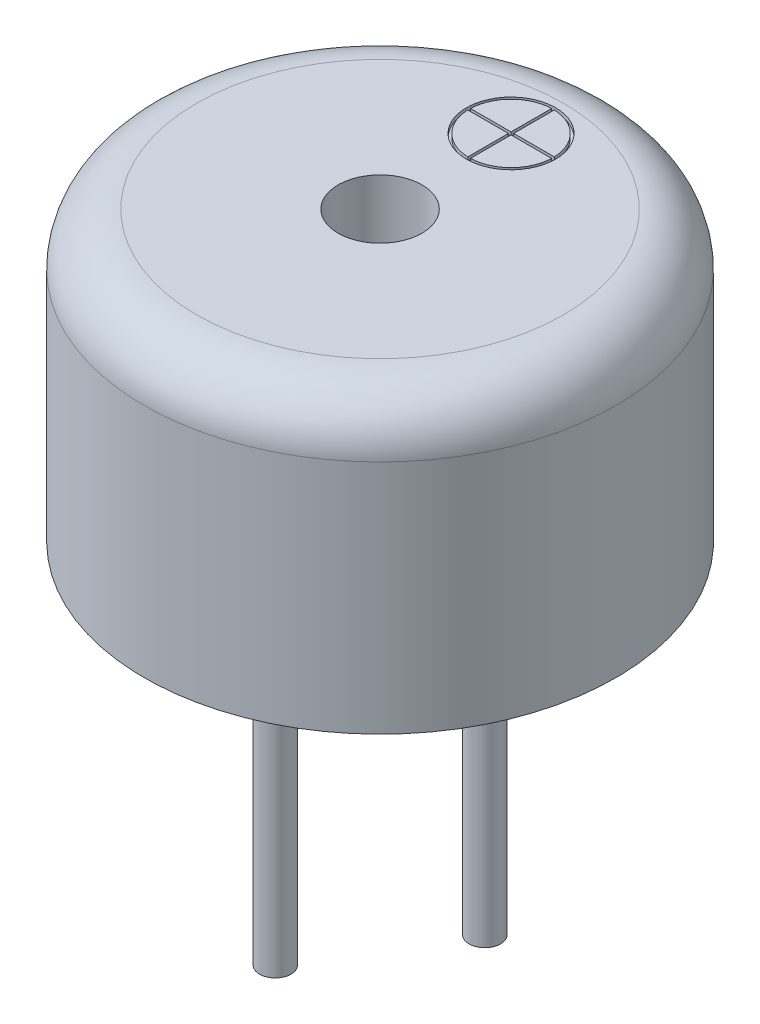
ISO-10303-21;
HEADER;
FILE_DESCRIPTION(('STEP AP214'),'2;1');
FILE_NAME('part.step','',(''),(''),'','','');
FILE_SCHEMA(('AUTOMOTIVE_DESIGN { 1 0 10303 214 1 1 1 1 }'));
ENDSEC;
DATA;
#1=APPLICATION_CONTEXT('core data for automotive mechanical design processes');
#2=APPLICATION_PROTOCOL_DEFINITION('international standard','automotive_design',2000,#1);
#3=PRODUCT_CONTEXT('',#1,'mechanical');
#4=PRODUCT('Part','Part','',(#3));
#5=PRODUCT_RELATED_PRODUCT_CATEGORY('part','',(#4));
#6=PRODUCT_DEFINITION_FORMATION('','',#4);
#7=PRODUCT_DEFINITION_CONTEXT('part definition',#1,'design');
#8=PRODUCT_DEFINITION('design','',#6,#7);
#9=PRODUCT_DEFINITION_SHAPE('','',#8);
#10=(LENGTH_UNIT() NAMED_UNIT(*) SI_UNIT(.MILLI.,.METRE.));
#11=(NAMED_UNIT(*) PLANE_ANGLE_UNIT() SI_UNIT($,.RADIAN.));
#12=(NAMED_UNIT(*) SI_UNIT($,.STERADIAN.) SOLID_ANGLE_UNIT());
#13=UNCERTAINTY_MEASURE_WITH_UNIT(LENGTH_MEASURE(1.E-05),#10,'distance_accuracy_value','');
#14=(GEOMETRIC_REPRESENTATION_CONTEXT(3) GLOBAL_UNCERTAINTY_ASSIGNED_CONTEXT((#13)) GLOBAL_UNIT_ASSIGNED_CONTEXT((#10,
#11,#12)) REPRESENTATION_CONTEXT('',''));
#15=CARTESIAN_POINT('',(0.,0.,0.));
#16=DIRECTION('',(0.,0.,1.));
#17=DIRECTION('',(1.,0.,0.));
#18=AXIS2_PLACEMENT_3D('',#15,#16,#17);
#19=CARTESIAN_POINT('',(0.,-7.5,-2.));
#20=DIRECTION('',(0.,1.,0.));
#21=DIRECTION('',(0.,0.,1.));
#22=AXIS2_PLACEMENT_3D('',#19,#20,#21);
#23=CYLINDRICAL_SURFACE('',#22,0.3);
#24=CARTESIAN_POINT('',(0.,-7.5,-2.));
#25=DIRECTION('',(0.,-1.,0.));
#26=DIRECTION('',(0.,0.,-1.));
#27=AXIS2_PLACEMENT_3D('',#24,#25,#26);
#28=CIRCLE('',#27,0.3);
#29=CARTESIAN_POINT('',(0.,-7.5,-2.3));
#30=VERTEX_POINT('',#29);
#31=EDGE_CURVE('E13',#30,#30,#28,.T.);
#32=ORIENTED_EDGE('',*,*,#31,.F.);
#33=EDGE_LOOP('',(#32));
#34=FACE_BOUND('',#33,.T.);
#35=CARTESIAN_POINT('',(0.,0.,-2.));
#36=DIRECTION('',(0.,-1.,0.));
#37=DIRECTION('',(0.,0.,-1.));
#38=AXIS2_PLACEMENT_3D('',#35,#36,#37);
#39=CIRCLE('',#38,0.3);
#40=CARTESIAN_POINT('',(0.,0.,-2.3));
#41=VERTEX_POINT('',#40);
#42=EDGE_CURVE('E80',#41,#41,#39,.T.);
#43=ORIENTED_EDGE('',*,*,#42,.T.);
#44=EDGE_LOOP('',(#43));
#45=FACE_BOUND('',#44,.T.);
#46=ADVANCED_FACE('F77',(#34,#45),#23,.T.);
#47=CARTESIAN_POINT('',(0.,-7.5,-2.));
#48=DIRECTION('',(0.,-1.,0.));
#49=DIRECTION('',(0.,0.,-1.));
#50=AXIS2_PLACEMENT_3D('',#47,#48,#49);
#51=PLANE('',#50);
#52=ORIENTED_EDGE('',*,*,#31,.T.);
#53=EDGE_LOOP('',(#52));
#54=FACE_BOUND('',#53,.T.);
#55=ADVANCED_FACE('F92',(#54),#51,.T.);
#56=CARTESIAN_POINT('',(0.,0.,-2.));
#57=DIRECTION('',(0.,-1.,0.));
#58=DIRECTION('',(0.,0.,-1.));
#59=AXIS2_PLACEMENT_3D('',#56,#57,#58);
#60=PLANE('',#59);
#61=ORIENTED_EDGE('',*,*,#42,.F.);
#62=EDGE_LOOP('',(#61));
#63=FACE_BOUND('',#62,.T.);
#64=ADVANCED_FACE('F90',(#63),#60,.F.);
#65=CLOSED_SHELL('',(#46,#55,#64));
#66=MANIFOLD_SOLID_BREP('B2',#65);
#67=CARTESIAN_POINT('',(0.,-7.5,2.));
#68=DIRECTION('',(0.,1.,0.));
#69=DIRECTION('',(0.,0.,1.));
#70=AXIS2_PLACEMENT_3D('',#67,#68,#69);
#71=CYLINDRICAL_SURFACE('',#70,0.3);
#72=CARTESIAN_POINT('',(0.,0.,2.));
#73=DIRECTION('',(0.,-1.,0.));
#74=DIRECTION('',(0.,0.,-1.));
#75=AXIS2_PLACEMENT_3D('',#72,#73,#74);
#76=CIRCLE('',#75,0.3);
#77=CARTESIAN_POINT('',(0.,0.,1.7));
#78=VERTEX_POINT('',#77);
#79=EDGE_CURVE('E76',#78,#78,#76,.T.);
#80=ORIENTED_EDGE('',*,*,#79,.T.);
#81=EDGE_LOOP('',(#80));
#82=FACE_BOUND('',#81,.T.);
#83=CARTESIAN_POINT('',(0.,-6.,2.));
#84=DIRECTION('',(0.,-1.,0.));
#85=DIRECTION('',(0.,0.,-1.));
#86=AXIS2_PLACEMENT_3D('',#83,#84,#85);
#87=CIRCLE('',#86,0.3);
#88=CARTESIAN_POINT('',(0.,-6.,1.7));
#89=VERTEX_POINT('',#88);
#90=EDGE_CURVE('E134',#89,#89,#87,.F.);
#91=ORIENTED_EDGE('',*,*,#90,.T.);
#92=EDGE_LOOP('',(#91));
#93=FACE_BOUND('',#92,.T.);
#94=ADVANCED_FACE('F128',(#82,#93),#71,.T.);
#95=CARTESIAN_POINT('',(0.,0.,2.));
#96=DIRECTION('',(0.,-1.,0.));
#97=DIRECTION('',(0.,0.,-1.));
#98=AXIS2_PLACEMENT_3D('',#95,#96,#97);
#99=PLANE('',#98);
#100=ORIENTED_EDGE('',*,*,#79,.F.);
#101=EDGE_LOOP('',(#100));
#102=FACE_BOUND('',#101,.T.);
#103=ADVANCED_FACE('F143',(#102),#99,.F.);
#104=CARTESIAN_POINT('',(0.,-6.,-2.));
#105=DIRECTION('',(0.,-1.,0.));
#106=DIRECTION('',(0.,0.,-1.));
#107=AXIS2_PLACEMENT_3D('',#104,#105,#106);
#108=PLANE('',#107);
#109=ORIENTED_EDGE('',*,*,#90,.F.);
#110=EDGE_LOOP('',(#109));
#111=FACE_BOUND('',#110,.T.);
#112=ADVANCED_FACE('F141',(#111),#108,.T.);
#113=CLOSED_SHELL('',(#94,#103,#112));
#114=MANIFOLD_SOLID_BREP('B8',#113);
#115=CARTESIAN_POINT('',(-3.5,5.5,0.));
#116=DIRECTION('',(0.,-1.,0.));
#117=DIRECTION('',(0.,0.,-1.));
#118=AXIS2_PLACEMENT_3D('',#115,#116,#117);
#119=PLANE('',#118);
#120=CARTESIAN_POINT('',(0.,5.5,-2.5));
#121=DIRECTION('',(0.,1.,0.));
#122=DIRECTION('',(1.,0.,0.));
#123=AXIS2_PLACEMENT_3D('',#120,#121,#122);
#124=CIRCLE('',#123,0.8509);
#125=CARTESIAN_POINT('',(0.8509,5.5,-2.5));
#126=VERTEX_POINT('',#125);
#127=EDGE_CURVE('E291',#126,#126,#124,.T.);
#128=ORIENTED_EDGE('',*,*,#127,.F.);
#129=EDGE_LOOP('',(#128));
#130=FACE_BOUND('',#129,.T.);
#131=CARTESIAN_POINT('',(0.,5.5,0.));
#132=DIRECTION('',(0.,-1.,0.));
#133=DIRECTION('',(0.,0.,-1.));
#134=AXIS2_PLACEMENT_3D('',#131,#132,#133);
#135=CIRCLE('',#134,3.5);
#136=CARTESIAN_POINT('',(0.,5.5,-3.5));
#137=VERTEX_POINT('',#136);
#138=EDGE_CURVE('E338',#137,#137,#135,.T.);
#139=ORIENTED_EDGE('',*,*,#138,.F.);
#140=EDGE_LOOP('',(#139));
#141=FACE_BOUND('',#140,.T.);
#142=CARTESIAN_POINT('',(0.,5.5,0.));
#143=DIRECTION('',(0.,1.,0.));
#144=DIRECTION('',(0.,0.,1.));
#145=AXIS2_PLACEMENT_3D('',#142,#143,#144);
#146=CIRCLE('',#145,0.8);
#147=CARTESIAN_POINT('',(0.,5.5,0.8));
#148=VERTEX_POINT('',#147);
#149=EDGE_CURVE('E339',#148,#148,#146,.T.);
#150=ORIENTED_EDGE('',*,*,#149,.F.);
#151=EDGE_LOOP('',(#150));
#152=FACE_BOUND('',#151,.T.);
#153=ADVANCED_FACE('F170',(#130,#141,#152),#119,.F.);
#154=CARTESIAN_POINT('',(0.,0.,0.));
#155=DIRECTION('',(0.,1.,0.));
#156=DIRECTION('',(0.,0.,1.));
#157=AXIS2_PLACEMENT_3D('',#154,#155,#156);
#158=PLANE('',#157);
#159=CARTESIAN_POINT('',(0.,0.,0.));
#160=DIRECTION('',(0.,-1.,0.));
#161=DIRECTION('',(0.,0.,-1.));
#162=AXIS2_PLACEMENT_3D('',#159,#160,#161);
#163=CIRCLE('',#162,4.5);
#164=CARTESIAN_POINT('',(0.,0.,-4.5));
#165=VERTEX_POINT('',#164);
#166=EDGE_CURVE('E126',#165,#165,#163,.T.);
#167=ORIENTED_EDGE('',*,*,#166,.T.);
#168=EDGE_LOOP('',(#167));
#169=FACE_BOUND('',#168,.T.);
#170=ADVANCED_FACE('F172',(#169),#158,.F.);
#171=CARTESIAN_POINT('',(0.,0.,0.));
#172=DIRECTION('',(0.,-1.,0.));
#173=DIRECTION('',(0.,0.,-1.));
#174=AXIS2_PLACEMENT_3D('',#171,#172,#173);
#175=CYLINDRICAL_SURFACE('',#174,4.5);
#176=ORIENTED_EDGE('',*,*,#166,.F.);
#177=EDGE_LOOP('',(#176));
#178=FACE_BOUND('',#177,.T.);
#179=CARTESIAN_POINT('',(0.,4.5,0.));
#180=DIRECTION('',(0.,-1.,0.));
#181=DIRECTION('',(0.,0.,-1.));
#182=AXIS2_PLACEMENT_3D('',#179,#180,#181);
#183=CIRCLE('',#182,4.5);
#184=CARTESIAN_POINT('',(0.,4.5,-4.5));
#185=VERTEX_POINT('',#184);
#186=EDGE_CURVE('E178',#185,#185,#183,.T.);
#187=ORIENTED_EDGE('',*,*,#186,.T.);
#188=EDGE_LOOP('',(#187));
#189=FACE_BOUND('',#188,.T.);
#190=ADVANCED_FACE('F346',(#178,#189),#175,.T.);
#191=CARTESIAN_POINT('',(0.,4.5,0.));
#192=DIRECTION('',(0.,-1.,0.));
#193=DIRECTION('',(0.,0.,-1.));
#194=AXIS2_PLACEMENT_3D('',#191,#192,#193);
#195=TOROIDAL_SURFACE('',#194,3.5,1.);
#196=ORIENTED_EDGE('',*,*,#186,.F.);
#197=EDGE_LOOP('',(#196));
#198=FACE_BOUND('',#197,.T.);
#199=ORIENTED_EDGE('',*,*,#138,.T.);
#200=EDGE_LOOP('',(#199));
#201=FACE_BOUND('',#200,.T.);
#202=ADVANCED_FACE('F348',(#198,#201),#195,.T.);
#203=CARTESIAN_POINT('',(0.,3.,0.));
#204=DIRECTION('',(0.,1.,0.));
#205=DIRECTION('',(0.,0.,1.));
#206=AXIS2_PLACEMENT_3D('',#203,#204,#205);
#207=CYLINDRICAL_SURFACE('',#206,0.8);
#208=CARTESIAN_POINT('',(0.,3.,0.));
#209=DIRECTION('',(0.,1.,0.));
#210=DIRECTION('',(0.,0.,1.));
#211=AXIS2_PLACEMENT_3D('',#208,#209,#210);
#212=CIRCLE('',#211,0.8);
#213=CARTESIAN_POINT('',(0.,3.,0.8));
#214=VERTEX_POINT('',#213);
#215=EDGE_CURVE('E335',#214,#214,#212,.T.);
#216=ORIENTED_EDGE('',*,*,#215,.F.);
#217=EDGE_LOOP('',(#216));
#218=FACE_BOUND('',#217,.T.);
#219=ORIENTED_EDGE('',*,*,#149,.T.);
#220=EDGE_LOOP('',(#219));
#221=FACE_BOUND('',#220,.T.);
#222=ADVANCED_FACE('F351',(#218,#221),#207,.F.);
#223=CARTESIAN_POINT('',(0.,3.,0.));
#224=DIRECTION('',(0.,1.,0.));
#225=DIRECTION('',(0.,0.,1.));
#226=AXIS2_PLACEMENT_3D('',#223,#224,#225);
#227=PLANE('',#226);
#228=ORIENTED_EDGE('',*,*,#215,.T.);
#229=EDGE_LOOP('',(#228));
#230=FACE_BOUND('',#229,.T.);
#231=ADVANCED_FACE('F364',(#230),#227,.T.);
#232=CARTESIAN_POINT('',(-0.0254000000000001,5.4238,-3.3255));
#233=DIRECTION('',(-1.,0.,0.));
#234=DIRECTION('',(0.,0.,1.));
#235=AXIS2_PLACEMENT_3D('',#232,#233,#234);
#236=PLANE('',#235);
#237=DIRECTION('',(0.,0.,1.));
#238=VECTOR('',#237,1.);
#239=CARTESIAN_POINT('',(-0.0254000000000001,5.5,-3.3255));
#240=LINE('',#239,#238);
#241=CARTESIAN_POINT('',(-0.0254,5.5,-2.4746));
#242=VERTEX_POINT('',#241);
#243=CARTESIAN_POINT('',(-0.0253999999999999,5.5,-1.7003032762353));
#244=VERTEX_POINT('',#243);
#245=EDGE_CURVE('E324',#242,#244,#240,.T.);
#246=ORIENTED_EDGE('',*,*,#245,.T.);
#247=DIRECTION('',(0.,1.,0.));
#248=VECTOR('',#247,1.);
#249=CARTESIAN_POINT('',(-0.0253999999999999,5.4238,-1.7003032762353));
#250=LINE('',#249,#248);
#251=CARTESIAN_POINT('',(-0.0253999999999999,5.4238,-1.7003032762353));
#252=VERTEX_POINT('',#251);
#253=EDGE_CURVE('E312',#252,#244,#250,.T.);
#254=ORIENTED_EDGE('',*,*,#253,.F.);
#255=DIRECTION('',(0.,0.,1.));
#256=VECTOR('',#255,1.);
#257=CARTESIAN_POINT('',(-0.0254000000000001,5.4238,-3.3255));
#258=LINE('',#257,#256);
#259=CARTESIAN_POINT('',(-0.0254000000000001,5.4238,-2.4746));
#260=VERTEX_POINT('',#259);
#261=EDGE_CURVE('E325',#260,#252,#258,.T.);
#262=ORIENTED_EDGE('',*,*,#261,.F.);
#263=DIRECTION('',(0.,-1.,0.));
#264=VECTOR('',#263,1.);
#265=CARTESIAN_POINT('',(-0.0254,5.4238,-2.4746));
#266=LINE('',#265,#264);
#267=EDGE_CURVE('E317',#242,#260,#266,.T.);
#268=ORIENTED_EDGE('',*,*,#267,.F.);
#269=EDGE_LOOP('',(#246,#254,#262,#268));
#270=FACE_BOUND('',#269,.T.);
#271=ADVANCED_FACE('F370',(#270),#236,.F.);
#272=DIRECTION('',(0.,-1.,0.));
#273=VECTOR('',#272,1.);
#274=CARTESIAN_POINT('',(-0.0254,5.4238,-2.5254));
#275=LINE('',#274,#273);
#276=CARTESIAN_POINT('',(-0.0254000000000001,5.5,-2.5254));
#277=VERTEX_POINT('',#276);
#278=CARTESIAN_POINT('',(-0.0254000000000001,5.4238,-2.5254));
#279=VERTEX_POINT('',#278);
#280=EDGE_CURVE('E322',#277,#279,#275,.T.);
#281=ORIENTED_EDGE('',*,*,#280,.T.);
#282=CARTESIAN_POINT('',(-0.0254000000000001,5.4238,-3.2996967237647));
#283=VERTEX_POINT('',#282);
#284=EDGE_CURVE('E327',#283,#279,#258,.T.);
#285=ORIENTED_EDGE('',*,*,#284,.F.);
#286=DIRECTION('',(0.,1.,0.));
#287=VECTOR('',#286,1.);
#288=CARTESIAN_POINT('',(-0.0254000000000001,5.4238,-3.2996967237647));
#289=LINE('',#288,#287);
#290=CARTESIAN_POINT('',(-0.0254000000000001,5.5,-3.2996967237647));
#291=VERTEX_POINT('',#290);
#292=EDGE_CURVE('E309',#291,#283,#289,.F.);
#293=ORIENTED_EDGE('',*,*,#292,.F.);
#294=EDGE_CURVE('E331',#291,#277,#240,.T.);
#295=ORIENTED_EDGE('',*,*,#294,.T.);
#296=EDGE_LOOP('',(#281,#285,#293,#295));
#297=FACE_BOUND('',#296,.T.);
#298=ADVANCED_FACE('F404',(#297),#236,.F.);
#299=CARTESIAN_POINT('',(0.0253999999999999,5.4238,-3.3255));
#300=DIRECTION('',(-1.,0.,0.));
#301=DIRECTION('',(0.,0.,1.));
#302=AXIS2_PLACEMENT_3D('',#299,#300,#301);
#303=PLANE('',#302);
#304=DIRECTION('',(0.,-1.,0.));
#305=VECTOR('',#304,1.);
#306=CARTESIAN_POINT('',(0.0254,5.4238,-2.4746));
#307=LINE('',#306,#305);
#308=CARTESIAN_POINT('',(0.0254000000000002,5.5,-2.4746));
#309=VERTEX_POINT('',#308);
#310=CARTESIAN_POINT('',(0.0254,5.4238,-2.4746));
#311=VERTEX_POINT('',#310);
#312=EDGE_CURVE('E315',#309,#311,#307,.T.);
#313=ORIENTED_EDGE('',*,*,#312,.T.);
#314=DIRECTION('',(0.,0.,1.));
#315=VECTOR('',#314,1.);
#316=CARTESIAN_POINT('',(0.0253999999999999,5.4238,-3.3255));
#317=LINE('',#316,#315);
#318=CARTESIAN_POINT('',(0.0254000000000001,5.4238,-1.7003032762353));
#319=VERTEX_POINT('',#318);
#320=EDGE_CURVE('E279',#311,#319,#317,.T.);
#321=ORIENTED_EDGE('',*,*,#320,.T.);
#322=DIRECTION('',(0.,1.,0.));
#323=VECTOR('',#322,1.);
#324=CARTESIAN_POINT('',(0.0254000000000001,5.4238,-1.7003032762353));
#325=LINE('',#324,#323);
#326=CARTESIAN_POINT('',(0.0254000000000001,5.5,-1.7003032762353));
#327=VERTEX_POINT('',#326);
#328=EDGE_CURVE('E267',#319,#327,#325,.T.);
#329=ORIENTED_EDGE('',*,*,#328,.T.);
#330=DIRECTION('',(0.,0.,1.));
#331=VECTOR('',#330,1.);
#332=CARTESIAN_POINT('',(0.0253999999999999,5.5,-3.3255));
#333=LINE('',#332,#331);
#334=EDGE_CURVE('E332',#309,#327,#333,.T.);
#335=ORIENTED_EDGE('',*,*,#334,.F.);
#336=EDGE_LOOP('',(#313,#321,#329,#335));
#337=FACE_BOUND('',#336,.T.);
#338=ADVANCED_FACE('F414',(#337),#303,.T.);
#339=CARTESIAN_POINT('',(0.0254,5.5,-3.2996967237647));
#340=VERTEX_POINT('',#339);
#341=CARTESIAN_POINT('',(0.0254,5.5,-2.5254));
#342=VERTEX_POINT('',#341);
#343=EDGE_CURVE('E193',#340,#342,#333,.T.);
#344=ORIENTED_EDGE('',*,*,#343,.F.);
#345=DIRECTION('',(0.,1.,0.));
#346=VECTOR('',#345,1.);
#347=CARTESIAN_POINT('',(0.0253999999999999,5.4238,-3.2996967237647));
#348=LINE('',#347,#346);
#349=CARTESIAN_POINT('',(0.0254,5.4238,-3.2996967237647));
#350=VERTEX_POINT('',#349);
#351=EDGE_CURVE('E281',#340,#350,#348,.F.);
#352=ORIENTED_EDGE('',*,*,#351,.T.);
#353=CARTESIAN_POINT('',(0.0254,5.4238,-2.5254));
#354=VERTEX_POINT('',#353);
#355=EDGE_CURVE('E329',#350,#354,#317,.T.);
#356=ORIENTED_EDGE('',*,*,#355,.T.);
#357=DIRECTION('',(0.,-1.,0.));
#358=VECTOR('',#357,1.);
#359=CARTESIAN_POINT('',(0.0254,5.4238,-2.5254));
#360=LINE('',#359,#358);
#361=EDGE_CURVE('E320',#342,#354,#360,.T.);
#362=ORIENTED_EDGE('',*,*,#361,.F.);
#363=EDGE_LOOP('',(#344,#352,#356,#362));
#364=FACE_BOUND('',#363,.T.);
#365=ADVANCED_FACE('F423',(#364),#303,.T.);
#366=CARTESIAN_POINT('',(0.,5.4238,0.));
#367=DIRECTION('',(0.,-1.,0.));
#368=DIRECTION('',(-1.,0.,0.));
#369=AXIS2_PLACEMENT_3D('',#366,#367,#368);
#370=PLANE('',#369);
#371=ORIENTED_EDGE('',*,*,#261,.T.);
#372=CARTESIAN_POINT('',(0.,5.4238,-2.5));
#373=DIRECTION('',(0.,1.,0.));
#374=DIRECTION('',(1.,0.,0.));
#375=AXIS2_PLACEMENT_3D('',#372,#373,#374);
#376=CIRCLE('',#375,0.8001);
#377=CARTESIAN_POINT('',(-0.799696723764703,5.4238,-2.4746));
#378=VERTEX_POINT('',#377);
#379=EDGE_CURVE('E270',#378,#252,#376,.T.);
#380=ORIENTED_EDGE('',*,*,#379,.F.);
#381=DIRECTION('',(1.,0.,0.));
#382=VECTOR('',#381,1.);
#383=CARTESIAN_POINT('',(0.8255,5.4238,-2.4746));
#384=LINE('',#383,#382);
#385=EDGE_CURVE('E282',#260,#378,#384,.F.);
#386=ORIENTED_EDGE('',*,*,#385,.F.);
#387=EDGE_LOOP('',(#371,#380,#386));
#388=FACE_BOUND('',#387,.T.);
#389=ORIENTED_EDGE('',*,*,#284,.T.);
#390=DIRECTION('',(1.,0.,0.));
#391=VECTOR('',#390,1.);
#392=CARTESIAN_POINT('',(0.8255,5.4238,-2.5254));
#393=LINE('',#392,#391);
#394=CARTESIAN_POINT('',(-0.799696723764703,5.4238,-2.5254));
#395=VERTEX_POINT('',#394);
#396=EDGE_CURVE('E301',#279,#395,#393,.F.);
#397=ORIENTED_EDGE('',*,*,#396,.T.);
#398=EDGE_CURVE('E273',#283,#395,#376,.T.);
#399=ORIENTED_EDGE('',*,*,#398,.F.);
#400=EDGE_LOOP('',(#389,#397,#399));
#401=FACE_BOUND('',#400,.T.);
#402=CARTESIAN_POINT('',(0.799696723764703,5.4238,-2.4746));
#403=VERTEX_POINT('',#402);
#404=EDGE_CURVE('E276',#403,#311,#384,.F.);
#405=ORIENTED_EDGE('',*,*,#404,.F.);
#406=EDGE_CURVE('E261',#319,#403,#376,.T.);
#407=ORIENTED_EDGE('',*,*,#406,.F.);
#408=ORIENTED_EDGE('',*,*,#320,.F.);
#409=EDGE_LOOP('',(#405,#407,#408));
#410=FACE_BOUND('',#409,.T.);
#411=CARTESIAN_POINT('',(0.799696723764703,5.4238,-2.5254));
#412=VERTEX_POINT('',#411);
#413=EDGE_CURVE('E274',#412,#350,#376,.T.);
#414=ORIENTED_EDGE('',*,*,#413,.F.);
#415=EDGE_CURVE('E299',#412,#354,#393,.F.);
#416=ORIENTED_EDGE('',*,*,#415,.T.);
#417=ORIENTED_EDGE('',*,*,#355,.F.);
#418=EDGE_LOOP('',(#414,#416,#417));
#419=FACE_BOUND('',#418,.T.);
#420=CARTESIAN_POINT('',(0.,5.4238,-2.5));
#421=DIRECTION('',(0.,1.,0.));
#422=DIRECTION('',(1.,0.,0.));
#423=AXIS2_PLACEMENT_3D('',#420,#421,#422);
#424=CIRCLE('',#423,0.8509);
#425=CARTESIAN_POINT('',(0.8509,5.4238,-2.5));
#426=VERTEX_POINT('',#425);
#427=EDGE_CURVE('E286',#426,#426,#424,.T.);
#428=ORIENTED_EDGE('',*,*,#427,.T.);
#429=EDGE_LOOP('',(#428));
#430=FACE_BOUND('',#429,.T.);
#431=ADVANCED_FACE('F277',(#388,#401,#410,#419,#430),#370,.F.);
#432=CARTESIAN_POINT('',(0.8255,5.4238,-2.5254));
#433=DIRECTION('',(0.,0.,-1.));
#434=DIRECTION('',(-1.,0.,0.));
#435=AXIS2_PLACEMENT_3D('',#432,#433,#434);
#436=PLANE('',#435);
#437=ORIENTED_EDGE('',*,*,#361,.T.);
#438=ORIENTED_EDGE('',*,*,#415,.F.);
#439=DIRECTION('',(0.,1.,0.));
#440=VECTOR('',#439,1.);
#441=CARTESIAN_POINT('',(0.799696723764703,5.4238,-2.5254));
#442=LINE('',#441,#440);
#443=CARTESIAN_POINT('',(0.799696723764703,5.5,-2.5254));
#444=VERTEX_POINT('',#443);
#445=EDGE_CURVE('E288',#444,#412,#442,.F.);
#446=ORIENTED_EDGE('',*,*,#445,.F.);
#447=DIRECTION('',(1.,0.,0.));
#448=VECTOR('',#447,1.);
#449=CARTESIAN_POINT('',(0.8255,5.5,-2.5254));
#450=LINE('',#449,#448);
#451=EDGE_CURVE('E303',#444,#342,#450,.F.);
#452=ORIENTED_EDGE('',*,*,#451,.T.);
#453=EDGE_LOOP('',(#437,#438,#446,#452));
#454=FACE_BOUND('',#453,.T.);
#455=ADVANCED_FACE('F440',(#454),#436,.F.);
#456=CARTESIAN_POINT('',(0.8255,5.4238,-2.4746));
#457=DIRECTION('',(0.,0.,-1.));
#458=DIRECTION('',(-1.,0.,0.));
#459=AXIS2_PLACEMENT_3D('',#456,#457,#458);
#460=PLANE('',#459);
#461=DIRECTION('',(1.,0.,0.));
#462=VECTOR('',#461,1.);
#463=CARTESIAN_POINT('',(0.8255,5.5,-2.4746));
#464=LINE('',#463,#462);
#465=CARTESIAN_POINT('',(0.799696723764703,5.5,-2.4746));
#466=VERTEX_POINT('',#465);
#467=EDGE_CURVE('E185',#466,#309,#464,.F.);
#468=ORIENTED_EDGE('',*,*,#467,.F.);
#469=DIRECTION('',(0.,1.,0.));
#470=VECTOR('',#469,1.);
#471=CARTESIAN_POINT('',(0.799696723764703,5.4238,-2.4746));
#472=LINE('',#471,#470);
#473=EDGE_CURVE('E265',#466,#403,#472,.F.);
#474=ORIENTED_EDGE('',*,*,#473,.T.);
#475=ORIENTED_EDGE('',*,*,#404,.T.);
#476=ORIENTED_EDGE('',*,*,#312,.F.);
#477=EDGE_LOOP('',(#468,#474,#475,#476));
#478=FACE_BOUND('',#477,.T.);
#479=ADVANCED_FACE('F284',(#478),#460,.T.);
#480=CARTESIAN_POINT('',(0.,5.4238,-2.5));
#481=DIRECTION('',(0.,1.,0.));
#482=DIRECTION('',(0.,0.,1.));
#483=AXIS2_PLACEMENT_3D('',#480,#481,#482);
#484=CYLINDRICAL_SURFACE('',#483,0.8001);
#485=ORIENTED_EDGE('',*,*,#406,.T.);
#486=ORIENTED_EDGE('',*,*,#473,.F.);
#487=CARTESIAN_POINT('',(0.,5.5,-2.5));
#488=DIRECTION('',(0.,1.,0.));
#489=DIRECTION('',(1.,0.,0.));
#490=AXIS2_PLACEMENT_3D('',#487,#488,#489);
#491=CIRCLE('',#490,0.8001);
#492=EDGE_CURVE('E572',#327,#466,#491,.T.);
#493=ORIENTED_EDGE('',*,*,#492,.F.);
#494=ORIENTED_EDGE('',*,*,#328,.F.);
#495=EDGE_LOOP('',(#485,#486,#493,#494));
#496=FACE_BOUND('',#495,.T.);
#497=ADVANCED_FACE('F263',(#496),#484,.T.);
#498=EDGE_CURVE('E271',#444,#340,#491,.T.);
#499=ORIENTED_EDGE('',*,*,#498,.F.);
#500=ORIENTED_EDGE('',*,*,#445,.T.);
#501=ORIENTED_EDGE('',*,*,#413,.T.);
#502=ORIENTED_EDGE('',*,*,#351,.F.);
#503=EDGE_LOOP('',(#499,#500,#501,#502));
#504=FACE_BOUND('',#503,.T.);
#505=ADVANCED_FACE('F469',(#504),#484,.T.);
#506=CARTESIAN_POINT('',(-0.799696723764703,5.5,-2.5254));
#507=VERTEX_POINT('',#506);
#508=EDGE_CURVE('E298',#277,#507,#450,.F.);
#509=ORIENTED_EDGE('',*,*,#508,.T.);
#510=DIRECTION('',(0.,1.,0.));
#511=VECTOR('',#510,1.);
#512=CARTESIAN_POINT('',(-0.799696723764703,5.4238,-2.5254));
#513=LINE('',#512,#511);
#514=EDGE_CURVE('E296',#395,#507,#513,.T.);
#515=ORIENTED_EDGE('',*,*,#514,.F.);
#516=ORIENTED_EDGE('',*,*,#396,.F.);
#517=ORIENTED_EDGE('',*,*,#280,.F.);
#518=EDGE_LOOP('',(#509,#515,#516,#517));
#519=FACE_BOUND('',#518,.T.);
#520=ADVANCED_FACE('F452',(#519),#436,.F.);
#521=ORIENTED_EDGE('',*,*,#267,.T.);
#522=ORIENTED_EDGE('',*,*,#385,.T.);
#523=DIRECTION('',(0.,1.,0.));
#524=VECTOR('',#523,1.);
#525=CARTESIAN_POINT('',(-0.799696723764703,5.4238,-2.4746));
#526=LINE('',#525,#524);
#527=CARTESIAN_POINT('',(-0.799696723764703,5.5,-2.4746));
#528=VERTEX_POINT('',#527);
#529=EDGE_CURVE('E285',#378,#528,#526,.T.);
#530=ORIENTED_EDGE('',*,*,#529,.T.);
#531=EDGE_CURVE('E306',#242,#528,#464,.F.);
#532=ORIENTED_EDGE('',*,*,#531,.F.);
#533=EDGE_LOOP('',(#521,#522,#530,#532));
#534=FACE_BOUND('',#533,.T.);
#535=ADVANCED_FACE('F461',(#534),#460,.T.);
#536=ORIENTED_EDGE('',*,*,#253,.T.);
#537=EDGE_CURVE('E573',#528,#244,#491,.T.);
#538=ORIENTED_EDGE('',*,*,#537,.F.);
#539=ORIENTED_EDGE('',*,*,#529,.F.);
#540=ORIENTED_EDGE('',*,*,#379,.T.);
#541=EDGE_LOOP('',(#536,#538,#539,#540));
#542=FACE_BOUND('',#541,.T.);
#543=ADVANCED_FACE('F480',(#542),#484,.T.);
#544=CARTESIAN_POINT('',(0.,5.4238,-2.5));
#545=DIRECTION('',(0.,1.,0.));
#546=DIRECTION('',(0.,0.,1.));
#547=AXIS2_PLACEMENT_3D('',#544,#545,#546);
#548=CYLINDRICAL_SURFACE('',#547,0.8509);
#549=ORIENTED_EDGE('',*,*,#427,.F.);
#550=EDGE_LOOP('',(#549));
#551=FACE_BOUND('',#550,.T.);
#552=ORIENTED_EDGE('',*,*,#127,.T.);
#553=EDGE_LOOP('',(#552));
#554=FACE_BOUND('',#553,.T.);
#555=ADVANCED_FACE('F504',(#551,#554),#548,.F.);
#556=ORIENTED_EDGE('',*,*,#292,.T.);
#557=ORIENTED_EDGE('',*,*,#398,.T.);
#558=ORIENTED_EDGE('',*,*,#514,.T.);
#559=EDGE_CURVE('E575',#291,#507,#491,.T.);
#560=ORIENTED_EDGE('',*,*,#559,.F.);
#561=EDGE_LOOP('',(#556,#557,#558,#560));
#562=FACE_BOUND('',#561,.T.);
#563=ADVANCED_FACE('F471',(#562),#484,.T.);
#564=ORIENTED_EDGE('',*,*,#537,.T.);
#565=ORIENTED_EDGE('',*,*,#245,.F.);
#566=ORIENTED_EDGE('',*,*,#531,.T.);
#567=EDGE_LOOP('',(#564,#565,#566));
#568=FACE_BOUND('',#567,.T.);
#569=ADVANCED_FACE('F360',(#568),#119,.F.);
#570=ORIENTED_EDGE('',*,*,#343,.T.);
#571=ORIENTED_EDGE('',*,*,#451,.F.);
#572=ORIENTED_EDGE('',*,*,#498,.T.);
#573=EDGE_LOOP('',(#570,#571,#572));
#574=FACE_BOUND('',#573,.T.);
#575=ADVANCED_FACE('F529',(#574),#119,.F.);
#576=ORIENTED_EDGE('',*,*,#334,.T.);
#577=ORIENTED_EDGE('',*,*,#492,.T.);
#578=ORIENTED_EDGE('',*,*,#467,.T.);
#579=EDGE_LOOP('',(#576,#577,#578));
#580=FACE_BOUND('',#579,.T.);
#581=ADVANCED_FACE('F376',(#580),#119,.F.);
#582=ORIENTED_EDGE('',*,*,#508,.F.);
#583=ORIENTED_EDGE('',*,*,#294,.F.);
#584=ORIENTED_EDGE('',*,*,#559,.T.);
#585=EDGE_LOOP('',(#582,#583,#584));
#586=FACE_BOUND('',#585,.T.);
#587=ADVANCED_FACE('F359',(#586),#119,.F.);
#588=CLOSED_SHELL('',(#153,#170,#190,#202,#222,#231,#271,#298,#338,#365,#431,#455,#479,#497,
#505,#520,#535,#543,#555,#563,#569,#575,#581,#587));
#589=MANIFOLD_SOLID_BREP('B71',#588);
#590=ADVANCED_BREP_SHAPE_REPRESENTATION('',(#18,#66,#114,#589),#14);
#591=SHAPE_DEFINITION_REPRESENTATION(#9,#590);
ENDSEC;
END-ISO-10303-21;
